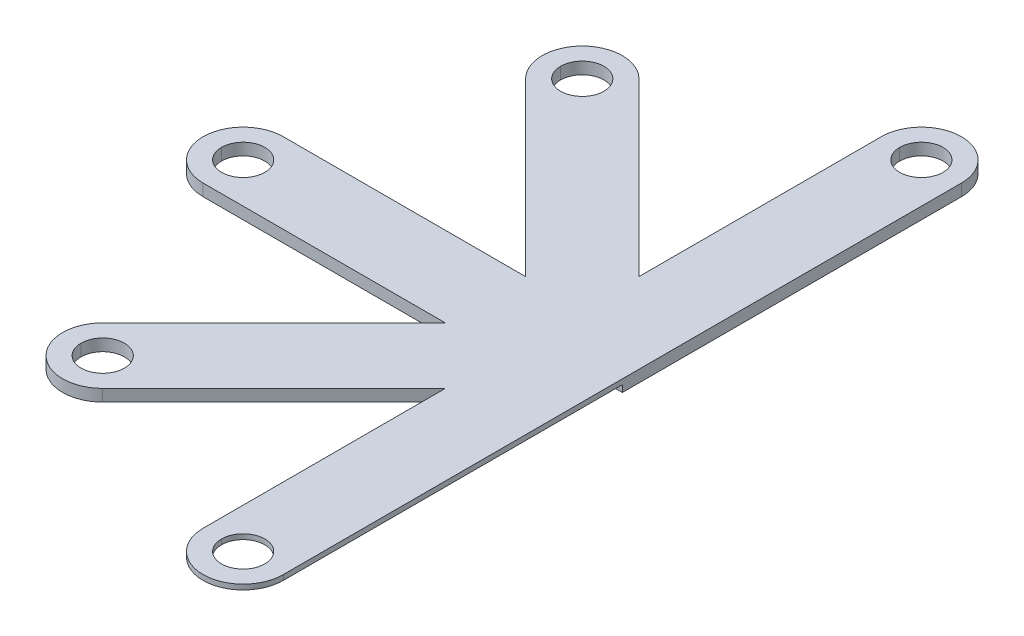
ISO-10303-21;
HEADER;
FILE_DESCRIPTION(('STEP AP214'),'2;1');
FILE_NAME('part.step','',(''),(''),'','','');
FILE_SCHEMA(('AUTOMOTIVE_DESIGN { 1 0 10303 214 1 1 1 1 }'));
ENDSEC;
DATA;
#1=APPLICATION_CONTEXT('core data for automotive mechanical design processes');
#2=APPLICATION_PROTOCOL_DEFINITION('international standard','automotive_design',2000,#1);
#3=PRODUCT_CONTEXT('',#1,'mechanical');
#4=PRODUCT('Part','Part','',(#3));
#5=PRODUCT_RELATED_PRODUCT_CATEGORY('part','',(#4));
#6=PRODUCT_DEFINITION_FORMATION('','',#4);
#7=PRODUCT_DEFINITION_CONTEXT('part definition',#1,'design');
#8=PRODUCT_DEFINITION('design','',#6,#7);
#9=PRODUCT_DEFINITION_SHAPE('','',#8);
#10=(LENGTH_UNIT() NAMED_UNIT(*) SI_UNIT(.MILLI.,.METRE.));
#11=(NAMED_UNIT(*) PLANE_ANGLE_UNIT() SI_UNIT($,.RADIAN.));
#12=(NAMED_UNIT(*) SI_UNIT($,.STERADIAN.) SOLID_ANGLE_UNIT());
#13=UNCERTAINTY_MEASURE_WITH_UNIT(LENGTH_MEASURE(1.E-05),#10,'distance_accuracy_value','');
#14=(GEOMETRIC_REPRESENTATION_CONTEXT(3) GLOBAL_UNCERTAINTY_ASSIGNED_CONTEXT((#13)) GLOBAL_UNIT_ASSIGNED_CONTEXT((#10,
#11,#12)) REPRESENTATION_CONTEXT('',''));
#15=CARTESIAN_POINT('',(0.,0.,0.));
#16=DIRECTION('',(0.,0.,1.));
#17=DIRECTION('',(1.,0.,0.));
#18=AXIS2_PLACEMENT_3D('',#15,#16,#17);
#19=CARTESIAN_POINT('',(-20.2946,-0.7112,2.4003));
#20=DIRECTION('',(0.,0.,1.));
#21=DIRECTION('',(1.,0.,0.));
#22=AXIS2_PLACEMENT_3D('',#19,#20,#21);
#23=PLANE('',#22);
#24=DIRECTION('',(1.,0.,0.));
#25=VECTOR('',#24,1.);
#26=CARTESIAN_POINT('',(-20.2946,-0.7112,2.4003));
#27=LINE('',#26,#25);
#28=CARTESIAN_POINT('',(-20.2946,-0.7112,2.4003));
#29=VERTEX_POINT('',#28);
#30=CARTESIAN_POINT('',(-5.79483681376443,-0.7112,2.4003));
#31=VERTEX_POINT('',#30);
#32=EDGE_CURVE('E11',#29,#31,#27,.T.);
#33=ORIENTED_EDGE('',*,*,#32,.T.);
#34=DIRECTION('',(0.,1.,0.));
#35=VECTOR('',#34,1.);
#36=CARTESIAN_POINT('',(-5.79483681376443,-0.7112,2.4003));
#37=LINE('',#36,#35);
#38=CARTESIAN_POINT('',(-5.79483681376443,0.,2.4003));
#39=VERTEX_POINT('',#38);
#40=EDGE_CURVE('E24',#31,#39,#37,.T.);
#41=ORIENTED_EDGE('',*,*,#40,.T.);
#42=DIRECTION('',(1.,0.,0.));
#43=VECTOR('',#42,1.);
#44=CARTESIAN_POINT('',(-20.2946,0.,2.4003));
#45=LINE('',#44,#43);
#46=CARTESIAN_POINT('',(-20.2946,0.,2.4003));
#47=VERTEX_POINT('',#46);
#48=EDGE_CURVE('E713',#47,#39,#45,.T.);
#49=ORIENTED_EDGE('',*,*,#48,.F.);
#50=DIRECTION('',(0.,1.,0.));
#51=VECTOR('',#50,1.);
#52=CARTESIAN_POINT('',(-20.2946,-0.7112,2.4003));
#53=LINE('',#52,#51);
#54=EDGE_CURVE('E708',#29,#47,#53,.T.);
#55=ORIENTED_EDGE('',*,*,#54,.F.);
#56=EDGE_LOOP('',(#33,#41,#49,#55));
#57=FACE_BOUND('',#56,.T.);
#58=ADVANCED_FACE('F16',(#57),#23,.T.);
#59=CARTESIAN_POINT('',(-20.2946,-0.7112,0.));
#60=DIRECTION('',(0.,-1.,0.));
#61=DIRECTION('',(1.,0.,0.));
#62=AXIS2_PLACEMENT_3D('',#59,#60,#61);
#63=CYLINDRICAL_SURFACE('',#62,2.4003);
#64=CARTESIAN_POINT('',(-20.2946,0.,0.));
#65=DIRECTION('',(0.,1.,0.));
#66=DIRECTION('',(1.,0.,0.));
#67=AXIS2_PLACEMENT_3D('',#64,#65,#66);
#68=CIRCLE('',#67,2.4003);
#69=CARTESIAN_POINT('',(-20.2946,0.,-2.4003));
#70=VERTEX_POINT('',#69);
#71=EDGE_CURVE('E703',#70,#47,#68,.T.);
#72=ORIENTED_EDGE('',*,*,#71,.F.);
#73=DIRECTION('',(0.,1.,0.));
#74=VECTOR('',#73,1.);
#75=CARTESIAN_POINT('',(-20.2946,-0.7112,-2.4003));
#76=LINE('',#75,#74);
#77=CARTESIAN_POINT('',(-20.2946,-0.7112,-2.4003));
#78=VERTEX_POINT('',#77);
#79=EDGE_CURVE('E698',#78,#70,#76,.T.);
#80=ORIENTED_EDGE('',*,*,#79,.F.);
#81=CARTESIAN_POINT('',(-20.2946,-0.7112,0.));
#82=DIRECTION('',(0.,1.,0.));
#83=DIRECTION('',(1.,0.,0.));
#84=AXIS2_PLACEMENT_3D('',#81,#82,#83);
#85=CIRCLE('',#84,2.4003);
#86=EDGE_CURVE('E693',#78,#29,#85,.T.);
#87=ORIENTED_EDGE('',*,*,#86,.T.);
#88=ORIENTED_EDGE('',*,*,#54,.T.);
#89=EDGE_LOOP('',(#72,#80,#87,#88));
#90=FACE_BOUND('',#89,.T.);
#91=ADVANCED_FACE('F860',(#90),#63,.T.);
#92=CARTESIAN_POINT('',(-14.3504492814685,-0.7112,14.3504492814685));
#93=DIRECTION('',(0.,1.,0.));
#94=DIRECTION('',(0.,0.,1.));
#95=AXIS2_PLACEMENT_3D('',#92,#93,#94);
#96=PLANE('',#95);
#97=DIRECTION('',(-0.707106781186528,0.,-0.707106781186567));
#98=VECTOR('',#97,1.);
#99=CARTESIAN_POINT('',(1.6972684068821,-0.7112,-1.6972684068821));
#100=LINE('',#99,#98);
#101=CARTESIAN_POINT('',(-2.4003,-0.7112,-5.79483681376443));
#102=VERTEX_POINT('',#101);
#103=CARTESIAN_POINT('',(-12.653180874586,-0.7112,-16.047717688351));
#104=VERTEX_POINT('',#103);
#105=EDGE_CURVE('E688',#102,#104,#100,.T.);
#106=ORIENTED_EDGE('',*,*,#105,.F.);
#107=DIRECTION('',(0.,0.,1.));
#108=VECTOR('',#107,1.);
#109=CARTESIAN_POINT('',(-2.4003,-0.7112,-20.2946));
#110=LINE('',#109,#108);
#111=CARTESIAN_POINT('',(-2.4003,-0.7112,-20.2946));
#112=VERTEX_POINT('',#111);
#113=EDGE_CURVE('E683',#112,#102,#110,.T.);
#114=ORIENTED_EDGE('',*,*,#113,.F.);
#115=CARTESIAN_POINT('',(0.,-0.7112,-20.2946));
#116=DIRECTION('',(0.,1.,0.));
#117=DIRECTION('',(1.,0.,0.));
#118=AXIS2_PLACEMENT_3D('',#115,#116,#117);
#119=CIRCLE('',#118,2.4003);
#120=CARTESIAN_POINT('',(2.4003,-0.7112,-20.2946));
#121=VERTEX_POINT('',#120);
#122=EDGE_CURVE('E678',#121,#112,#119,.T.);
#123=ORIENTED_EDGE('',*,*,#122,.F.);
#124=DIRECTION('',(0.,0.,-1.));
#125=VECTOR('',#124,1.);
#126=CARTESIAN_POINT('',(2.4003,-0.7112,0.));
#127=LINE('',#126,#125);
#128=CARTESIAN_POINT('',(2.4003,-0.7112,0.));
#129=VERTEX_POINT('',#128);
#130=EDGE_CURVE('E673',#129,#121,#127,.T.);
#131=ORIENTED_EDGE('',*,*,#130,.F.);
#132=DIRECTION('',(1.,0.,0.));
#133=VECTOR('',#132,1.);
#134=CARTESIAN_POINT('',(-2.4003,-0.7112,0.));
#135=LINE('',#134,#133);
#136=CARTESIAN_POINT('',(0.,-0.7112,0.));
#137=VERTEX_POINT('',#136);
#138=EDGE_CURVE('E668',#137,#129,#135,.T.);
#139=ORIENTED_EDGE('',*,*,#138,.F.);
#140=DIRECTION('',(-0.707106781186548,0.,-0.707106781186548));
#141=VECTOR('',#140,1.);
#142=CARTESIAN_POINT('',(1.6972684068821,-0.7112,1.6972684068821));
#143=LINE('',#142,#141);
#144=CARTESIAN_POINT('',(1.6972684068821,-0.7112,1.6972684068821));
#145=VERTEX_POINT('',#144);
#146=EDGE_CURVE('E663',#145,#137,#143,.T.);
#147=ORIENTED_EDGE('',*,*,#146,.F.);
#148=DIRECTION('',(0.707106781186528,0.,-0.707106781186567));
#149=VECTOR('',#148,1.);
#150=CARTESIAN_POINT('',(-12.653180874586,-0.7112,16.047717688351));
#151=LINE('',#150,#149);
#152=CARTESIAN_POINT('',(-12.653180874586,-0.7112,16.047717688351));
#153=VERTEX_POINT('',#152);
#154=EDGE_CURVE('E658',#153,#145,#151,.T.);
#155=ORIENTED_EDGE('',*,*,#154,.F.);
#156=CARTESIAN_POINT('',(-14.3504492814685,-0.7112,14.3504492814685));
#157=DIRECTION('',(0.,1.,0.));
#158=DIRECTION('',(1.,0.,0.));
#159=AXIS2_PLACEMENT_3D('',#156,#157,#158);
#160=CIRCLE('',#159,2.40030000000061);
#161=CARTESIAN_POINT('',(-16.047717688351,-0.7112,12.653180874586));
#162=VERTEX_POINT('',#161);
#163=EDGE_CURVE('E653',#162,#153,#160,.T.);
#164=ORIENTED_EDGE('',*,*,#163,.F.);
#165=DIRECTION('',(-0.707106781186567,0.,0.707106781186528));
#166=VECTOR('',#165,1.);
#167=CARTESIAN_POINT('',(-1.6972684068821,-0.7112,-1.6972684068821));
#168=LINE('',#167,#166);
#169=EDGE_CURVE('E648',#31,#162,#168,.T.);
#170=ORIENTED_EDGE('',*,*,#169,.F.);
#171=ORIENTED_EDGE('',*,*,#32,.F.);
#172=ORIENTED_EDGE('',*,*,#86,.F.);
#173=DIRECTION('',(-1.,0.,0.));
#174=VECTOR('',#173,1.);
#175=CARTESIAN_POINT('',(0.,-0.7112,-2.4003));
#176=LINE('',#175,#174);
#177=CARTESIAN_POINT('',(-5.79483681376443,-0.7112,-2.4003));
#178=VERTEX_POINT('',#177);
#179=EDGE_CURVE('E643',#178,#78,#176,.T.);
#180=ORIENTED_EDGE('',*,*,#179,.F.);
#181=DIRECTION('',(0.707106781186567,0.,0.707106781186528));
#182=VECTOR('',#181,1.);
#183=CARTESIAN_POINT('',(-16.047717688351,-0.7112,-12.653180874586));
#184=LINE('',#183,#182);
#185=CARTESIAN_POINT('',(-16.047717688351,-0.7112,-12.653180874586));
#186=VERTEX_POINT('',#185);
#187=EDGE_CURVE('E638',#186,#178,#184,.T.);
#188=ORIENTED_EDGE('',*,*,#187,.F.);
#189=CARTESIAN_POINT('',(-14.3504492814685,-0.7112,-14.3504492814685));
#190=DIRECTION('',(0.,1.,0.));
#191=DIRECTION('',(1.,0.,0.));
#192=AXIS2_PLACEMENT_3D('',#189,#190,#191);
#193=CIRCLE('',#192,2.40030000000061);
#194=EDGE_CURVE('E633',#104,#186,#193,.T.);
#195=ORIENTED_EDGE('',*,*,#194,.F.);
#196=EDGE_LOOP('',(#106,#114,#123,#131,#139,#147,#155,#164,#170,#171,#172,#180,#188,#195));
#197=FACE_BOUND('',#196,.T.);
#198=CARTESIAN_POINT('',(-14.350449281469,-0.7112,14.350449281469));
#199=DIRECTION('',(0.,1.,0.));
#200=DIRECTION('',(1.,0.,0.));
#201=AXIS2_PLACEMENT_3D('',#198,#199,#200);
#202=CIRCLE('',#201,1.2954);
#203=CARTESIAN_POINT('',(-13.055049281469,-0.7112,14.350449281469));
#204=VERTEX_POINT('',#203);
#205=CARTESIAN_POINT('',(-15.645849281469,-0.7112,14.350449281469));
#206=VERTEX_POINT('',#205);
#207=EDGE_CURVE('E629',#204,#206,#202,.T.);
#208=ORIENTED_EDGE('',*,*,#207,.T.);
#209=CARTESIAN_POINT('',(-14.350449281469,-0.7112,14.350449281469));
#210=DIRECTION('',(0.,1.,0.));
#211=DIRECTION('',(1.,0.,0.));
#212=AXIS2_PLACEMENT_3D('',#209,#210,#211);
#213=CIRCLE('',#212,1.2954);
#214=EDGE_CURVE('E625',#206,#204,#213,.T.);
#215=ORIENTED_EDGE('',*,*,#214,.T.);
#216=EDGE_LOOP('',(#208,#215));
#217=FACE_BOUND('',#216,.T.);
#218=CARTESIAN_POINT('',(-20.2946,-0.7112,0.));
#219=DIRECTION('',(0.,1.,0.));
#220=DIRECTION('',(1.,0.,0.));
#221=AXIS2_PLACEMENT_3D('',#218,#219,#220);
#222=CIRCLE('',#221,1.2954);
#223=CARTESIAN_POINT('',(-18.9992,-0.7112,0.));
#224=VERTEX_POINT('',#223);
#225=CARTESIAN_POINT('',(-21.59,-0.7112,0.));
#226=VERTEX_POINT('',#225);
#227=EDGE_CURVE('E621',#224,#226,#222,.T.);
#228=ORIENTED_EDGE('',*,*,#227,.T.);
#229=CARTESIAN_POINT('',(-20.2946,-0.7112,0.));
#230=DIRECTION('',(0.,1.,0.));
#231=DIRECTION('',(1.,0.,0.));
#232=AXIS2_PLACEMENT_3D('',#229,#230,#231);
#233=CIRCLE('',#232,1.2954);
#234=EDGE_CURVE('E617',#226,#224,#233,.T.);
#235=ORIENTED_EDGE('',*,*,#234,.T.);
#236=EDGE_LOOP('',(#228,#235));
#237=FACE_BOUND('',#236,.T.);
#238=CARTESIAN_POINT('',(-14.350449281469,-0.7112,-14.350449281469));
#239=DIRECTION('',(0.,1.,0.));
#240=DIRECTION('',(1.,0.,0.));
#241=AXIS2_PLACEMENT_3D('',#238,#239,#240);
#242=CIRCLE('',#241,1.2954);
#243=CARTESIAN_POINT('',(-13.055049281469,-0.7112,-14.350449281469));
#244=VERTEX_POINT('',#243);
#245=CARTESIAN_POINT('',(-15.645849281469,-0.7112,-14.350449281469));
#246=VERTEX_POINT('',#245);
#247=EDGE_CURVE('E613',#244,#246,#242,.T.);
#248=ORIENTED_EDGE('',*,*,#247,.T.);
#249=CARTESIAN_POINT('',(-14.350449281469,-0.7112,-14.350449281469));
#250=DIRECTION('',(0.,1.,0.));
#251=DIRECTION('',(1.,0.,0.));
#252=AXIS2_PLACEMENT_3D('',#249,#250,#251);
#253=CIRCLE('',#252,1.2954);
#254=EDGE_CURVE('E609',#246,#244,#253,.T.);
#255=ORIENTED_EDGE('',*,*,#254,.T.);
#256=EDGE_LOOP('',(#248,#255));
#257=FACE_BOUND('',#256,.T.);
#258=CARTESIAN_POINT('',(0.,-0.7112,-20.2946));
#259=DIRECTION('',(0.,1.,0.));
#260=DIRECTION('',(1.,0.,0.));
#261=AXIS2_PLACEMENT_3D('',#258,#259,#260);
#262=CIRCLE('',#261,1.2954);
#263=CARTESIAN_POINT('',(1.2954,-0.7112,-20.2946));
#264=VERTEX_POINT('',#263);
#265=CARTESIAN_POINT('',(-1.2954,-0.7112,-20.2946));
#266=VERTEX_POINT('',#265);
#267=EDGE_CURVE('E605',#264,#266,#262,.T.);
#268=ORIENTED_EDGE('',*,*,#267,.T.);
#269=CARTESIAN_POINT('',(0.,-0.7112,-20.2946));
#270=DIRECTION('',(0.,1.,0.));
#271=DIRECTION('',(1.,0.,0.));
#272=AXIS2_PLACEMENT_3D('',#269,#270,#271);
#273=CIRCLE('',#272,1.2954);
#274=EDGE_CURVE('E603',#266,#264,#273,.T.);
#275=ORIENTED_EDGE('',*,*,#274,.T.);
#276=EDGE_LOOP('',(#268,#275));
#277=FACE_BOUND('',#276,.T.);
#278=ADVANCED_FACE('F814',(#197,#217,#237,#257,#277),#96,.F.);
#279=CARTESIAN_POINT('',(0.,-0.7112,-20.2946));
#280=DIRECTION('',(0.,-1.,0.));
#281=DIRECTION('',(0.,0.,-1.));
#282=AXIS2_PLACEMENT_3D('',#279,#280,#281);
#283=CYLINDRICAL_SURFACE('',#282,1.2954);
#284=ORIENTED_EDGE('',*,*,#274,.F.);
#285=CARTESIAN_POINT('',(-1.2954,0.,-20.2946));
#286=DIRECTION('',(0.,-1.,0.));
#287=VECTOR('',#286,1.);
#288=LINE('',#285,#287);
#289=CARTESIAN_POINT('',(-1.2954,0.,-20.2946));
#290=VERTEX_POINT('',#289);
#291=EDGE_CURVE('E573',#290,#266,#288,.T.);
#292=ORIENTED_EDGE('',*,*,#291,.F.);
#293=CARTESIAN_POINT('',(0.,0.,-20.2946));
#294=DIRECTION('',(0.,1.,0.));
#295=DIRECTION('',(1.,0.,0.));
#296=AXIS2_PLACEMENT_3D('',#293,#294,#295);
#297=CIRCLE('',#296,1.2954);
#298=CARTESIAN_POINT('',(1.2954,0.,-20.2946));
#299=VERTEX_POINT('',#298);
#300=EDGE_CURVE('E590',#290,#299,#297,.T.);
#301=ORIENTED_EDGE('',*,*,#300,.T.);
#302=CARTESIAN_POINT('',(1.2954,0.,-20.2946));
#303=DIRECTION('',(0.,-1.,0.));
#304=VECTOR('',#303,1.);
#305=LINE('',#302,#304);
#306=EDGE_CURVE('E575',#299,#264,#305,.T.);
#307=ORIENTED_EDGE('',*,*,#306,.T.);
#308=EDGE_LOOP('',(#284,#292,#301,#307));
#309=FACE_BOUND('',#308,.T.);
#310=ADVANCED_FACE('F556',(#309),#283,.F.);
#311=CARTESIAN_POINT('',(0.,-0.7112,-20.2946));
#312=DIRECTION('',(0.,-1.,0.));
#313=DIRECTION('',(0.,0.,1.));
#314=AXIS2_PLACEMENT_3D('',#311,#312,#313);
#315=CYLINDRICAL_SURFACE('',#314,1.2954);
#316=CARTESIAN_POINT('',(0.,0.,-20.2946));
#317=DIRECTION('',(0.,1.,0.));
#318=DIRECTION('',(1.,0.,0.));
#319=AXIS2_PLACEMENT_3D('',#316,#317,#318);
#320=CIRCLE('',#319,1.2954);
#321=EDGE_CURVE('E537',#299,#290,#320,.T.);
#322=ORIENTED_EDGE('',*,*,#321,.T.);
#323=ORIENTED_EDGE('',*,*,#291,.T.);
#324=ORIENTED_EDGE('',*,*,#267,.F.);
#325=ORIENTED_EDGE('',*,*,#306,.F.);
#326=EDGE_LOOP('',(#322,#323,#324,#325));
#327=FACE_BOUND('',#326,.T.);
#328=ADVANCED_FACE('F546',(#327),#315,.F.);
#329=CARTESIAN_POINT('',(0.,0.,20.2946));
#330=DIRECTION('',(0.,1.,0.));
#331=DIRECTION('',(0.,0.,1.));
#332=AXIS2_PLACEMENT_3D('',#329,#330,#331);
#333=PLANE('',#332);
#334=DIRECTION('',(0.,0.,1.));
#335=VECTOR('',#334,1.);
#336=CARTESIAN_POINT('',(-2.4003,0.,-20.2946));
#337=LINE('',#336,#335);
#338=CARTESIAN_POINT('',(-2.4003,0.,-20.2946));
#339=VERTEX_POINT('',#338);
#340=CARTESIAN_POINT('',(-2.4003,0.,-5.79483681376443));
#341=VERTEX_POINT('',#340);
#342=EDGE_CURVE('E533',#339,#341,#337,.T.);
#343=ORIENTED_EDGE('',*,*,#342,.T.);
#344=DIRECTION('',(-0.707106781186528,0.,-0.707106781186567));
#345=VECTOR('',#344,1.);
#346=CARTESIAN_POINT('',(1.6972684068821,0.,-1.6972684068821));
#347=LINE('',#346,#345);
#348=CARTESIAN_POINT('',(-12.653180874586,0.,-16.047717688351));
#349=VERTEX_POINT('',#348);
#350=EDGE_CURVE('E529',#341,#349,#347,.T.);
#351=ORIENTED_EDGE('',*,*,#350,.T.);
#352=CARTESIAN_POINT('',(-14.3504492814685,0.,-14.3504492814685));
#353=DIRECTION('',(0.,1.,0.));
#354=DIRECTION('',(1.,0.,0.));
#355=AXIS2_PLACEMENT_3D('',#352,#353,#354);
#356=CIRCLE('',#355,2.40030000000061);
#357=CARTESIAN_POINT('',(-16.047717688351,0.,-12.653180874586));
#358=VERTEX_POINT('',#357);
#359=EDGE_CURVE('E525',#349,#358,#356,.T.);
#360=ORIENTED_EDGE('',*,*,#359,.T.);
#361=DIRECTION('',(0.707106781186567,0.,0.707106781186528));
#362=VECTOR('',#361,1.);
#363=CARTESIAN_POINT('',(-16.047717688351,0.,-12.653180874586));
#364=LINE('',#363,#362);
#365=CARTESIAN_POINT('',(-5.79483681376443,0.,-2.4003));
#366=VERTEX_POINT('',#365);
#367=EDGE_CURVE('E521',#358,#366,#364,.T.);
#368=ORIENTED_EDGE('',*,*,#367,.T.);
#369=DIRECTION('',(-1.,0.,0.));
#370=VECTOR('',#369,1.);
#371=CARTESIAN_POINT('',(0.,0.,-2.4003));
#372=LINE('',#371,#370);
#373=EDGE_CURVE('E516',#366,#70,#372,.T.);
#374=ORIENTED_EDGE('',*,*,#373,.T.);
#375=ORIENTED_EDGE('',*,*,#71,.T.);
#376=ORIENTED_EDGE('',*,*,#48,.T.);
#377=DIRECTION('',(-0.707106781186567,0.,0.707106781186528));
#378=VECTOR('',#377,1.);
#379=CARTESIAN_POINT('',(-1.6972684068821,0.,-1.6972684068821));
#380=LINE('',#379,#378);
#381=CARTESIAN_POINT('',(-16.047717688351,0.,12.653180874586));
#382=VERTEX_POINT('',#381);
#383=EDGE_CURVE('E512',#39,#382,#380,.T.);
#384=ORIENTED_EDGE('',*,*,#383,.T.);
#385=CARTESIAN_POINT('',(-14.3504492814685,0.,14.3504492814685));
#386=DIRECTION('',(0.,1.,0.));
#387=DIRECTION('',(1.,0.,0.));
#388=AXIS2_PLACEMENT_3D('',#385,#386,#387);
#389=CIRCLE('',#388,2.40030000000061);
#390=CARTESIAN_POINT('',(-12.653180874586,0.,16.047717688351));
#391=VERTEX_POINT('',#390);
#392=EDGE_CURVE('E508',#382,#391,#389,.T.);
#393=ORIENTED_EDGE('',*,*,#392,.T.);
#394=DIRECTION('',(0.707106781186528,0.,-0.707106781186567));
#395=VECTOR('',#394,1.);
#396=CARTESIAN_POINT('',(-12.653180874586,0.,16.047717688351));
#397=LINE('',#396,#395);
#398=CARTESIAN_POINT('',(-2.4003,0.,5.79483681376443));
#399=VERTEX_POINT('',#398);
#400=EDGE_CURVE('E504',#391,#399,#397,.T.);
#401=ORIENTED_EDGE('',*,*,#400,.T.);
#402=DIRECTION('',(0.,0.,1.));
#403=VECTOR('',#402,1.);
#404=CARTESIAN_POINT('',(-2.4003,0.,0.));
#405=LINE('',#404,#403);
#406=CARTESIAN_POINT('',(-2.4003,0.,20.2946));
#407=VERTEX_POINT('',#406);
#408=EDGE_CURVE('E500',#399,#407,#405,.T.);
#409=ORIENTED_EDGE('',*,*,#408,.T.);
#410=CARTESIAN_POINT('',(0.,0.,20.2946));
#411=DIRECTION('',(0.,1.,0.));
#412=DIRECTION('',(1.,0.,0.));
#413=AXIS2_PLACEMENT_3D('',#410,#411,#412);
#414=CIRCLE('',#413,2.4003);
#415=CARTESIAN_POINT('',(2.4003,0.,20.2946));
#416=VERTEX_POINT('',#415);
#417=EDGE_CURVE('E206',#407,#416,#414,.T.);
#418=ORIENTED_EDGE('',*,*,#417,.T.);
#419=DIRECTION('',(0.,0.,-1.));
#420=VECTOR('',#419,1.);
#421=CARTESIAN_POINT('',(2.4003,0.,20.2946));
#422=LINE('',#421,#420);
#423=CARTESIAN_POINT('',(2.4003,0.,-20.2946));
#424=VERTEX_POINT('',#423);
#425=EDGE_CURVE('E493',#416,#424,#422,.T.);
#426=ORIENTED_EDGE('',*,*,#425,.T.);
#427=CARTESIAN_POINT('',(0.,0.,-20.2946));
#428=DIRECTION('',(0.,1.,0.));
#429=DIRECTION('',(1.,0.,0.));
#430=AXIS2_PLACEMENT_3D('',#427,#428,#429);
#431=CIRCLE('',#430,2.4003);
#432=EDGE_CURVE('E489',#424,#339,#431,.T.);
#433=ORIENTED_EDGE('',*,*,#432,.T.);
#434=EDGE_LOOP('',(#343,#351,#360,#368,#374,#375,#376,#384,#393,#401,#409,#418,#426,#433));
#435=FACE_BOUND('',#434,.T.);
#436=CARTESIAN_POINT('',(0.,0.,20.2946));
#437=DIRECTION('',(0.,1.,0.));
#438=DIRECTION('',(1.,0.,0.));
#439=AXIS2_PLACEMENT_3D('',#436,#437,#438);
#440=CIRCLE('',#439,1.2954);
#441=CARTESIAN_POINT('',(1.2954,0.,20.2946));
#442=VERTEX_POINT('',#441);
#443=CARTESIAN_POINT('',(-1.2954,0.,20.2946));
#444=VERTEX_POINT('',#443);
#445=EDGE_CURVE('E485',#442,#444,#440,.T.);
#446=ORIENTED_EDGE('',*,*,#445,.F.);
#447=CARTESIAN_POINT('',(0.,0.,20.2946));
#448=DIRECTION('',(0.,1.,0.));
#449=DIRECTION('',(1.,0.,0.));
#450=AXIS2_PLACEMENT_3D('',#447,#448,#449);
#451=CIRCLE('',#450,1.2954);
#452=EDGE_CURVE('E481',#444,#442,#451,.T.);
#453=ORIENTED_EDGE('',*,*,#452,.F.);
#454=EDGE_LOOP('',(#446,#453));
#455=FACE_BOUND('',#454,.T.);
#456=CARTESIAN_POINT('',(-14.350449281469,0.,14.350449281469));
#457=DIRECTION('',(0.,1.,0.));
#458=DIRECTION('',(1.,0.,0.));
#459=AXIS2_PLACEMENT_3D('',#456,#457,#458);
#460=CIRCLE('',#459,1.2954);
#461=CARTESIAN_POINT('',(-13.055049281469,0.,14.350449281469));
#462=VERTEX_POINT('',#461);
#463=CARTESIAN_POINT('',(-15.645849281469,0.,14.350449281469));
#464=VERTEX_POINT('',#463);
#465=EDGE_CURVE('E477',#462,#464,#460,.T.);
#466=ORIENTED_EDGE('',*,*,#465,.F.);
#467=CARTESIAN_POINT('',(-14.350449281469,0.,14.350449281469));
#468=DIRECTION('',(0.,1.,0.));
#469=DIRECTION('',(1.,0.,0.));
#470=AXIS2_PLACEMENT_3D('',#467,#468,#469);
#471=CIRCLE('',#470,1.2954);
#472=EDGE_CURVE('E473',#464,#462,#471,.T.);
#473=ORIENTED_EDGE('',*,*,#472,.F.);
#474=EDGE_LOOP('',(#466,#473));
#475=FACE_BOUND('',#474,.T.);
#476=CARTESIAN_POINT('',(-20.2946,0.,0.));
#477=DIRECTION('',(0.,1.,0.));
#478=DIRECTION('',(1.,0.,0.));
#479=AXIS2_PLACEMENT_3D('',#476,#477,#478);
#480=CIRCLE('',#479,1.2954);
#481=CARTESIAN_POINT('',(-18.9992,0.,0.));
#482=VERTEX_POINT('',#481);
#483=CARTESIAN_POINT('',(-21.59,0.,0.));
#484=VERTEX_POINT('',#483);
#485=EDGE_CURVE('E469',#482,#484,#480,.T.);
#486=ORIENTED_EDGE('',*,*,#485,.F.);
#487=CARTESIAN_POINT('',(-20.2946,0.,0.));
#488=DIRECTION('',(0.,1.,0.));
#489=DIRECTION('',(1.,0.,0.));
#490=AXIS2_PLACEMENT_3D('',#487,#488,#489);
#491=CIRCLE('',#490,1.2954);
#492=EDGE_CURVE('E465',#484,#482,#491,.T.);
#493=ORIENTED_EDGE('',*,*,#492,.F.);
#494=EDGE_LOOP('',(#486,#493));
#495=FACE_BOUND('',#494,.T.);
#496=CARTESIAN_POINT('',(-14.350449281469,0.,-14.350449281469));
#497=DIRECTION('',(0.,1.,0.));
#498=DIRECTION('',(1.,0.,0.));
#499=AXIS2_PLACEMENT_3D('',#496,#497,#498);
#500=CIRCLE('',#499,1.2954);
#501=CARTESIAN_POINT('',(-13.055049281469,0.,-14.350449281469));
#502=VERTEX_POINT('',#501);
#503=CARTESIAN_POINT('',(-15.645849281469,0.,-14.350449281469));
#504=VERTEX_POINT('',#503);
#505=EDGE_CURVE('E461',#502,#504,#500,.T.);
#506=ORIENTED_EDGE('',*,*,#505,.F.);
#507=CARTESIAN_POINT('',(-14.350449281469,0.,-14.350449281469));
#508=DIRECTION('',(0.,1.,0.));
#509=DIRECTION('',(1.,0.,0.));
#510=AXIS2_PLACEMENT_3D('',#507,#508,#509);
#511=CIRCLE('',#510,1.2954);
#512=EDGE_CURVE('E459',#504,#502,#511,.T.);
#513=ORIENTED_EDGE('',*,*,#512,.F.);
#514=EDGE_LOOP('',(#506,#513));
#515=FACE_BOUND('',#514,.T.);
#516=ORIENTED_EDGE('',*,*,#321,.F.);
#517=ORIENTED_EDGE('',*,*,#300,.F.);
#518=EDGE_LOOP('',(#516,#517));
#519=FACE_BOUND('',#518,.T.);
#520=ADVANCED_FACE('F555',(#435,#455,#475,#495,#515,#519),#333,.T.);
#521=CARTESIAN_POINT('',(-14.350449281469,-0.7112,-14.350449281469));
#522=DIRECTION('',(0.,-1.,0.));
#523=DIRECTION('',(0.,0.,-1.));
#524=AXIS2_PLACEMENT_3D('',#521,#522,#523);
#525=CYLINDRICAL_SURFACE('',#524,1.2954);
#526=ORIENTED_EDGE('',*,*,#254,.F.);
#527=CARTESIAN_POINT('',(-15.645849281469,0.,-14.350449281469));
#528=DIRECTION('',(0.,-1.,0.));
#529=VECTOR('',#528,1.);
#530=LINE('',#527,#529);
#531=EDGE_CURVE('E435',#504,#246,#530,.T.);
#532=ORIENTED_EDGE('',*,*,#531,.F.);
#533=ORIENTED_EDGE('',*,*,#512,.T.);
#534=CARTESIAN_POINT('',(-13.055049281469,0.,-14.350449281469));
#535=DIRECTION('',(0.,-1.,0.));
#536=VECTOR('',#535,1.);
#537=LINE('',#534,#536);
#538=EDGE_CURVE('E449',#502,#244,#537,.T.);
#539=ORIENTED_EDGE('',*,*,#538,.T.);
#540=EDGE_LOOP('',(#526,#532,#533,#539));
#541=FACE_BOUND('',#540,.T.);
#542=ADVANCED_FACE('F417',(#541),#525,.F.);
#543=CARTESIAN_POINT('',(-14.350449281469,-0.7112,-14.350449281469));
#544=DIRECTION('',(0.,-1.,0.));
#545=DIRECTION('',(0.,0.,1.));
#546=AXIS2_PLACEMENT_3D('',#543,#544,#545);
#547=CYLINDRICAL_SURFACE('',#546,1.2954);
#548=ORIENTED_EDGE('',*,*,#505,.T.);
#549=ORIENTED_EDGE('',*,*,#531,.T.);
#550=ORIENTED_EDGE('',*,*,#247,.F.);
#551=ORIENTED_EDGE('',*,*,#538,.F.);
#552=EDGE_LOOP('',(#548,#549,#550,#551));
#553=FACE_BOUND('',#552,.T.);
#554=ADVANCED_FACE('F408',(#553),#547,.F.);
#555=CARTESIAN_POINT('',(-20.2946,-0.7112,0.));
#556=DIRECTION('',(0.,-1.,0.));
#557=DIRECTION('',(0.,0.,-1.));
#558=AXIS2_PLACEMENT_3D('',#555,#556,#557);
#559=CYLINDRICAL_SURFACE('',#558,1.2954);
#560=ORIENTED_EDGE('',*,*,#234,.F.);
#561=CARTESIAN_POINT('',(-21.59,0.,0.));
#562=DIRECTION('',(0.,-1.,0.));
#563=VECTOR('',#562,1.);
#564=LINE('',#561,#563);
#565=EDGE_CURVE('E379',#484,#226,#564,.T.);
#566=ORIENTED_EDGE('',*,*,#565,.F.);
#567=ORIENTED_EDGE('',*,*,#492,.T.);
#568=CARTESIAN_POINT('',(-18.9992,0.,0.));
#569=DIRECTION('',(0.,-1.,0.));
#570=VECTOR('',#569,1.);
#571=LINE('',#568,#570);
#572=EDGE_CURVE('E393',#482,#224,#571,.T.);
#573=ORIENTED_EDGE('',*,*,#572,.T.);
#574=EDGE_LOOP('',(#560,#566,#567,#573));
#575=FACE_BOUND('',#574,.T.);
#576=ADVANCED_FACE('F361',(#575),#559,.F.);
#577=CARTESIAN_POINT('',(-20.2946,-0.7112,0.));
#578=DIRECTION('',(0.,-1.,0.));
#579=DIRECTION('',(0.,0.,1.));
#580=AXIS2_PLACEMENT_3D('',#577,#578,#579);
#581=CYLINDRICAL_SURFACE('',#580,1.2954);
#582=ORIENTED_EDGE('',*,*,#485,.T.);
#583=ORIENTED_EDGE('',*,*,#565,.T.);
#584=ORIENTED_EDGE('',*,*,#227,.F.);
#585=ORIENTED_EDGE('',*,*,#572,.F.);
#586=EDGE_LOOP('',(#582,#583,#584,#585));
#587=FACE_BOUND('',#586,.T.);
#588=ADVANCED_FACE('F352',(#587),#581,.F.);
#589=CARTESIAN_POINT('',(-14.350449281469,-0.7112,14.350449281469));
#590=DIRECTION('',(0.,-1.,0.));
#591=DIRECTION('',(0.,0.,-1.));
#592=AXIS2_PLACEMENT_3D('',#589,#590,#591);
#593=CYLINDRICAL_SURFACE('',#592,1.2954);
#594=ORIENTED_EDGE('',*,*,#214,.F.);
#595=CARTESIAN_POINT('',(-15.645849281469,0.,14.350449281469));
#596=DIRECTION('',(0.,-1.,0.));
#597=VECTOR('',#596,1.);
#598=LINE('',#595,#597);
#599=EDGE_CURVE('E324',#464,#206,#598,.T.);
#600=ORIENTED_EDGE('',*,*,#599,.F.);
#601=ORIENTED_EDGE('',*,*,#472,.T.);
#602=CARTESIAN_POINT('',(-13.055049281469,0.,14.350449281469));
#603=DIRECTION('',(0.,-1.,0.));
#604=VECTOR('',#603,1.);
#605=LINE('',#602,#604);
#606=EDGE_CURVE('E289',#462,#204,#605,.T.);
#607=ORIENTED_EDGE('',*,*,#606,.T.);
#608=EDGE_LOOP('',(#594,#600,#601,#607));
#609=FACE_BOUND('',#608,.T.);
#610=ADVANCED_FACE('F306',(#609),#593,.F.);
#611=CARTESIAN_POINT('',(-14.350449281469,-0.7112,14.350449281469));
#612=DIRECTION('',(0.,-1.,0.));
#613=DIRECTION('',(0.,0.,1.));
#614=AXIS2_PLACEMENT_3D('',#611,#612,#613);
#615=CYLINDRICAL_SURFACE('',#614,1.2954);
#616=ORIENTED_EDGE('',*,*,#465,.T.);
#617=ORIENTED_EDGE('',*,*,#599,.T.);
#618=ORIENTED_EDGE('',*,*,#207,.F.);
#619=ORIENTED_EDGE('',*,*,#606,.F.);
#620=EDGE_LOOP('',(#616,#617,#618,#619));
#621=FACE_BOUND('',#620,.T.);
#622=ADVANCED_FACE('F297',(#621),#615,.F.);
#623=CARTESIAN_POINT('',(0.,-0.3048,20.2946));
#624=DIRECTION('',(0.,-1.,0.));
#625=DIRECTION('',(0.,0.,-1.));
#626=AXIS2_PLACEMENT_3D('',#623,#624,#625);
#627=CYLINDRICAL_SURFACE('',#626,1.2954);
#628=CARTESIAN_POINT('',(0.,-0.3048,20.2946));
#629=DIRECTION('',(0.,1.,0.));
#630=DIRECTION('',(1.,0.,0.));
#631=AXIS2_PLACEMENT_3D('',#628,#629,#630);
#632=CIRCLE('',#631,1.2954);
#633=CARTESIAN_POINT('',(-1.2954,-0.3048,20.2946));
#634=VERTEX_POINT('',#633);
#635=CARTESIAN_POINT('',(1.2954,-0.3048,20.2946));
#636=VERTEX_POINT('',#635);
#637=EDGE_CURVE('E286',#634,#636,#632,.T.);
#638=ORIENTED_EDGE('',*,*,#637,.F.);
#639=CARTESIAN_POINT('',(-1.2954,0.,20.2946));
#640=DIRECTION('',(0.,-1.,0.));
#641=VECTOR('',#640,1.);
#642=LINE('',#639,#641);
#643=EDGE_CURVE('E265',#444,#634,#642,.T.);
#644=ORIENTED_EDGE('',*,*,#643,.F.);
#645=ORIENTED_EDGE('',*,*,#452,.T.);
#646=CARTESIAN_POINT('',(1.2954,0.,20.2946));
#647=DIRECTION('',(0.,-1.,0.));
#648=VECTOR('',#647,1.);
#649=LINE('',#646,#648);
#650=EDGE_CURVE('E219',#442,#636,#649,.T.);
#651=ORIENTED_EDGE('',*,*,#650,.T.);
#652=EDGE_LOOP('',(#638,#644,#645,#651));
#653=FACE_BOUND('',#652,.T.);
#654=ADVANCED_FACE('F243',(#653),#627,.F.);
#655=CARTESIAN_POINT('',(0.,-0.3048,20.2946));
#656=DIRECTION('',(0.,-1.,0.));
#657=DIRECTION('',(0.,0.,1.));
#658=AXIS2_PLACEMENT_3D('',#655,#656,#657);
#659=CYLINDRICAL_SURFACE('',#658,1.2954);
#660=ORIENTED_EDGE('',*,*,#445,.T.);
#661=ORIENTED_EDGE('',*,*,#643,.T.);
#662=CARTESIAN_POINT('',(0.,-0.3048,20.2946));
#663=DIRECTION('',(0.,1.,0.));
#664=DIRECTION('',(1.,0.,0.));
#665=AXIS2_PLACEMENT_3D('',#662,#663,#664);
#666=CIRCLE('',#665,1.2954);
#667=EDGE_CURVE('E215',#636,#634,#666,.T.);
#668=ORIENTED_EDGE('',*,*,#667,.F.);
#669=ORIENTED_EDGE('',*,*,#650,.F.);
#670=EDGE_LOOP('',(#660,#661,#668,#669));
#671=FACE_BOUND('',#670,.T.);
#672=ADVANCED_FACE('F233',(#671),#659,.F.);
#673=CARTESIAN_POINT('',(0.,-0.3048,20.2946));
#674=DIRECTION('',(0.,1.,0.));
#675=DIRECTION('',(0.,0.,1.));
#676=AXIS2_PLACEMENT_3D('',#673,#674,#675);
#677=PLANE('',#676);
#678=ORIENTED_EDGE('',*,*,#667,.T.);
#679=ORIENTED_EDGE('',*,*,#637,.T.);
#680=EDGE_LOOP('',(#678,#679));
#681=FACE_BOUND('',#680,.T.);
#682=DIRECTION('',(0.,0.,1.));
#683=VECTOR('',#682,1.);
#684=CARTESIAN_POINT('',(-2.4003,-0.3048,0.));
#685=LINE('',#684,#683);
#686=CARTESIAN_POINT('',(-2.4003,-0.3048,5.79483681376443));
#687=VERTEX_POINT('',#686);
#688=CARTESIAN_POINT('',(-2.4003,-0.3048,20.2946));
#689=VERTEX_POINT('',#688);
#690=EDGE_CURVE('E194',#687,#689,#685,.T.);
#691=ORIENTED_EDGE('',*,*,#690,.F.);
#692=DIRECTION('',(0.707106781186528,0.,-0.707106781186567));
#693=VECTOR('',#692,1.);
#694=CARTESIAN_POINT('',(-8.45003159311785,-0.3048,11.8445684068826));
#695=LINE('',#694,#693);
#696=CARTESIAN_POINT('',(1.6972684068821,-0.3048,1.6972684068821));
#697=VERTEX_POINT('',#696);
#698=EDGE_CURVE('E216',#687,#697,#695,.T.);
#699=ORIENTED_EDGE('',*,*,#698,.T.);
#700=DIRECTION('',(-0.707106781186548,0.,-0.707106781186548));
#701=VECTOR('',#700,1.);
#702=CARTESIAN_POINT('',(10.1473,-0.3048,10.1473));
#703=LINE('',#702,#701);
#704=CARTESIAN_POINT('',(0.,-0.3048,0.));
#705=VERTEX_POINT('',#704);
#706=EDGE_CURVE('E221',#697,#705,#703,.T.);
#707=ORIENTED_EDGE('',*,*,#706,.T.);
#708=DIRECTION('',(-1.,0.,0.));
#709=VECTOR('',#708,1.);
#710=CARTESIAN_POINT('',(2.4003,-0.3048,0.));
#711=LINE('',#710,#709);
#712=CARTESIAN_POINT('',(2.4003,-0.3048,0.));
#713=VERTEX_POINT('',#712);
#714=EDGE_CURVE('E796',#713,#705,#711,.T.);
#715=ORIENTED_EDGE('',*,*,#714,.F.);
#716=DIRECTION('',(0.,0.,-1.));
#717=VECTOR('',#716,1.);
#718=CARTESIAN_POINT('',(2.4003,-0.3048,20.2946));
#719=LINE('',#718,#717);
#720=CARTESIAN_POINT('',(2.4003,-0.3048,20.2946));
#721=VERTEX_POINT('',#720);
#722=EDGE_CURVE('E197',#721,#713,#719,.T.);
#723=ORIENTED_EDGE('',*,*,#722,.F.);
#724=CARTESIAN_POINT('',(0.,-0.3048,20.2946));
#725=DIRECTION('',(0.,1.,0.));
#726=DIRECTION('',(1.,0.,0.));
#727=AXIS2_PLACEMENT_3D('',#724,#725,#726);
#728=CIRCLE('',#727,2.4003);
#729=EDGE_CURVE('E190',#689,#721,#728,.T.);
#730=ORIENTED_EDGE('',*,*,#729,.F.);
#731=EDGE_LOOP('',(#691,#699,#707,#715,#723,#730));
#732=FACE_BOUND('',#731,.T.);
#733=ADVANCED_FACE('F192',(#681,#732),#677,.F.);
#734=CARTESIAN_POINT('',(0.,-0.3048,20.2946));
#735=DIRECTION('',(0.,-1.,0.));
#736=DIRECTION('',(0.,0.,-1.));
#737=AXIS2_PLACEMENT_3D('',#734,#735,#736);
#738=CYLINDRICAL_SURFACE('',#737,2.4003);
#739=ORIENTED_EDGE('',*,*,#417,.F.);
#740=DIRECTION('',(0.,1.,0.));
#741=VECTOR('',#740,1.);
#742=CARTESIAN_POINT('',(-2.4003,-0.3048,20.2946));
#743=LINE('',#742,#741);
#744=EDGE_CURVE('E201',#689,#407,#743,.T.);
#745=ORIENTED_EDGE('',*,*,#744,.F.);
#746=ORIENTED_EDGE('',*,*,#729,.T.);
#747=DIRECTION('',(0.,1.,0.));
#748=VECTOR('',#747,1.);
#749=CARTESIAN_POINT('',(2.4003,-0.3048,20.2946));
#750=LINE('',#749,#748);
#751=EDGE_CURVE('E209',#721,#416,#750,.T.);
#752=ORIENTED_EDGE('',*,*,#751,.T.);
#753=EDGE_LOOP('',(#739,#745,#746,#752));
#754=FACE_BOUND('',#753,.T.);
#755=ADVANCED_FACE('F205',(#754),#738,.T.);
#756=CARTESIAN_POINT('',(2.4003,-0.3048,20.2946));
#757=DIRECTION('',(1.,0.,0.));
#758=DIRECTION('',(0.,0.,-1.));
#759=AXIS2_PLACEMENT_3D('',#756,#757,#758);
#760=PLANE('',#759);
#761=ORIENTED_EDGE('',*,*,#425,.F.);
#762=ORIENTED_EDGE('',*,*,#751,.F.);
#763=ORIENTED_EDGE('',*,*,#722,.T.);
#764=DIRECTION('',(0.,1.,0.));
#765=VECTOR('',#764,1.);
#766=CARTESIAN_POINT('',(2.4003,-0.7112,0.));
#767=LINE('',#766,#765);
#768=EDGE_CURVE('E781',#129,#713,#767,.T.);
#769=ORIENTED_EDGE('',*,*,#768,.F.);
#770=ORIENTED_EDGE('',*,*,#130,.T.);
#771=DIRECTION('',(0.,1.,0.));
#772=VECTOR('',#771,1.);
#773=CARTESIAN_POINT('',(2.4003,-0.7112,-20.2946));
#774=LINE('',#773,#772);
#775=EDGE_CURVE('E776',#121,#424,#774,.T.);
#776=ORIENTED_EDGE('',*,*,#775,.T.);
#777=EDGE_LOOP('',(#761,#762,#763,#769,#770,#776));
#778=FACE_BOUND('',#777,.T.);
#779=ADVANCED_FACE('F820',(#778),#760,.T.);
#780=CARTESIAN_POINT('',(0.,-0.7112,-20.2946));
#781=DIRECTION('',(0.,-1.,0.));
#782=DIRECTION('',(0.,0.,1.));
#783=AXIS2_PLACEMENT_3D('',#780,#781,#782);
#784=CYLINDRICAL_SURFACE('',#783,2.4003);
#785=ORIENTED_EDGE('',*,*,#432,.F.);
#786=ORIENTED_EDGE('',*,*,#775,.F.);
#787=ORIENTED_EDGE('',*,*,#122,.T.);
#788=DIRECTION('',(0.,1.,0.));
#789=VECTOR('',#788,1.);
#790=CARTESIAN_POINT('',(-2.4003,-0.7112,-20.2946));
#791=LINE('',#790,#789);
#792=EDGE_CURVE('E771',#112,#339,#791,.T.);
#793=ORIENTED_EDGE('',*,*,#792,.T.);
#794=EDGE_LOOP('',(#785,#786,#787,#793));
#795=FACE_BOUND('',#794,.T.);
#796=ADVANCED_FACE('F849',(#795),#784,.T.);
#797=CARTESIAN_POINT('',(-2.4003,-0.7112,-20.2946));
#798=DIRECTION('',(-1.,0.,0.));
#799=DIRECTION('',(0.,0.,1.));
#800=AXIS2_PLACEMENT_3D('',#797,#798,#799);
#801=PLANE('',#800);
#802=ORIENTED_EDGE('',*,*,#113,.T.);
#803=DIRECTION('',(0.,1.,0.));
#804=VECTOR('',#803,1.);
#805=CARTESIAN_POINT('',(-2.4003,-0.7112,-5.79483681376443));
#806=LINE('',#805,#804);
#807=EDGE_CURVE('E766',#102,#341,#806,.T.);
#808=ORIENTED_EDGE('',*,*,#807,.T.);
#809=ORIENTED_EDGE('',*,*,#342,.F.);
#810=ORIENTED_EDGE('',*,*,#792,.F.);
#811=EDGE_LOOP('',(#802,#808,#809,#810));
#812=FACE_BOUND('',#811,.T.);
#813=ADVANCED_FACE('F846',(#812),#801,.T.);
#814=CARTESIAN_POINT('',(1.6972684068821,-0.7112,-1.6972684068821));
#815=DIRECTION('',(0.707106781186567,0.,-0.707106781186528));
#816=DIRECTION('',(-0.707106781186528,0.,-0.707106781186567));
#817=AXIS2_PLACEMENT_3D('',#814,#815,#816);
#818=PLANE('',#817);
#819=ORIENTED_EDGE('',*,*,#807,.F.);
#820=ORIENTED_EDGE('',*,*,#105,.T.);
#821=DIRECTION('',(0.,1.,0.));
#822=VECTOR('',#821,1.);
#823=CARTESIAN_POINT('',(-12.653180874586,-0.7112,-16.047717688351));
#824=LINE('',#823,#822);
#825=EDGE_CURVE('E761',#104,#349,#824,.T.);
#826=ORIENTED_EDGE('',*,*,#825,.T.);
#827=ORIENTED_EDGE('',*,*,#350,.F.);
#828=EDGE_LOOP('',(#819,#820,#826,#827));
#829=FACE_BOUND('',#828,.T.);
#830=ADVANCED_FACE('F843',(#829),#818,.T.);
#831=CARTESIAN_POINT('',(-14.3504492814685,-0.7112,-14.3504492814685));
#832=DIRECTION('',(0.,-1.,0.));
#833=DIRECTION('',(0.707106781186547,0.,0.707106781186548));
#834=AXIS2_PLACEMENT_3D('',#831,#832,#833);
#835=CYLINDRICAL_SURFACE('',#834,2.40030000000061);
#836=ORIENTED_EDGE('',*,*,#359,.F.);
#837=ORIENTED_EDGE('',*,*,#825,.F.);
#838=ORIENTED_EDGE('',*,*,#194,.T.);
#839=DIRECTION('',(0.,1.,0.));
#840=VECTOR('',#839,1.);
#841=CARTESIAN_POINT('',(-16.047717688351,-0.7112,-12.653180874586));
#842=LINE('',#841,#840);
#843=EDGE_CURVE('E756',#186,#358,#842,.T.);
#844=ORIENTED_EDGE('',*,*,#843,.T.);
#845=EDGE_LOOP('',(#836,#837,#838,#844));
#846=FACE_BOUND('',#845,.T.);
#847=ADVANCED_FACE('F839',(#846),#835,.T.);
#848=CARTESIAN_POINT('',(-16.047717688351,-0.7112,-12.653180874586));
#849=DIRECTION('',(-0.707106781186528,0.,0.707106781186567));
#850=DIRECTION('',(0.707106781186567,0.,0.707106781186528));
#851=AXIS2_PLACEMENT_3D('',#848,#849,#850);
#852=PLANE('',#851);
#853=ORIENTED_EDGE('',*,*,#187,.T.);
#854=DIRECTION('',(0.,1.,0.));
#855=VECTOR('',#854,1.);
#856=CARTESIAN_POINT('',(-5.79483681376443,-0.7112,-2.4003));
#857=LINE('',#856,#855);
#858=EDGE_CURVE('E751',#178,#366,#857,.T.);
#859=ORIENTED_EDGE('',*,*,#858,.T.);
#860=ORIENTED_EDGE('',*,*,#367,.F.);
#861=ORIENTED_EDGE('',*,*,#843,.F.);
#862=EDGE_LOOP('',(#853,#859,#860,#861));
#863=FACE_BOUND('',#862,.T.);
#864=ADVANCED_FACE('F834',(#863),#852,.T.);
#865=CARTESIAN_POINT('',(0.,-0.7112,-2.4003));
#866=DIRECTION('',(0.,0.,-1.));
#867=DIRECTION('',(-1.,0.,0.));
#868=AXIS2_PLACEMENT_3D('',#865,#866,#867);
#869=PLANE('',#868);
#870=ORIENTED_EDGE('',*,*,#858,.F.);
#871=ORIENTED_EDGE('',*,*,#179,.T.);
#872=ORIENTED_EDGE('',*,*,#79,.T.);
#873=ORIENTED_EDGE('',*,*,#373,.F.);
#874=EDGE_LOOP('',(#870,#871,#872,#873));
#875=FACE_BOUND('',#874,.T.);
#876=ADVANCED_FACE('F830',(#875),#869,.T.);
#877=CARTESIAN_POINT('',(-2.4003,-0.7112,0.));
#878=DIRECTION('',(0.,0.,1.));
#879=DIRECTION('',(1.,0.,0.));
#880=AXIS2_PLACEMENT_3D('',#877,#878,#879);
#881=PLANE('',#880);
#882=ORIENTED_EDGE('',*,*,#714,.T.);
#883=DIRECTION('',(0.,-1.,0.));
#884=VECTOR('',#883,1.);
#885=CARTESIAN_POINT('',(0.,-0.7112,0.));
#886=LINE('',#885,#884);
#887=EDGE_CURVE('E746',#705,#137,#886,.T.);
#888=ORIENTED_EDGE('',*,*,#887,.T.);
#889=ORIENTED_EDGE('',*,*,#138,.T.);
#890=ORIENTED_EDGE('',*,*,#768,.T.);
#891=EDGE_LOOP('',(#882,#888,#889,#890));
#892=FACE_BOUND('',#891,.T.);
#893=ADVANCED_FACE('F810',(#892),#881,.T.);
#894=CARTESIAN_POINT('',(1.6972684068821,-0.7112,1.6972684068821));
#895=DIRECTION('',(0.707106781186548,0.,-0.707106781186548));
#896=DIRECTION('',(-0.707106781186548,0.,-0.707106781186548));
#897=AXIS2_PLACEMENT_3D('',#894,#895,#896);
#898=PLANE('',#897);
#899=ORIENTED_EDGE('',*,*,#887,.F.);
#900=ORIENTED_EDGE('',*,*,#706,.F.);
#901=DIRECTION('',(0.,1.,0.));
#902=VECTOR('',#901,1.);
#903=CARTESIAN_POINT('',(1.6972684068821,-0.7112,1.6972684068821));
#904=LINE('',#903,#902);
#905=EDGE_CURVE('E741',#145,#697,#904,.T.);
#906=ORIENTED_EDGE('',*,*,#905,.F.);
#907=ORIENTED_EDGE('',*,*,#146,.T.);
#908=EDGE_LOOP('',(#899,#900,#906,#907));
#909=FACE_BOUND('',#908,.T.);
#910=ADVANCED_FACE('F812',(#909),#898,.T.);
#911=CARTESIAN_POINT('',(-12.653180874586,-0.7112,16.047717688351));
#912=DIRECTION('',(0.707106781186567,0.,0.707106781186528));
#913=DIRECTION('',(0.707106781186528,0.,-0.707106781186567));
#914=AXIS2_PLACEMENT_3D('',#911,#912,#913);
#915=PLANE('',#914);
#916=ORIENTED_EDGE('',*,*,#698,.F.);
#917=DIRECTION('',(0.,1.,0.));
#918=VECTOR('',#917,1.);
#919=CARTESIAN_POINT('',(-2.4003,-0.3048,5.79483681376443));
#920=LINE('',#919,#918);
#921=EDGE_CURVE('E214',#687,#399,#920,.T.);
#922=ORIENTED_EDGE('',*,*,#921,.T.);
#923=ORIENTED_EDGE('',*,*,#400,.F.);
#924=DIRECTION('',(0.,1.,0.));
#925=VECTOR('',#924,1.);
#926=CARTESIAN_POINT('',(-12.653180874586,-0.7112,16.047717688351));
#927=LINE('',#926,#925);
#928=EDGE_CURVE('E731',#153,#391,#927,.T.);
#929=ORIENTED_EDGE('',*,*,#928,.F.);
#930=ORIENTED_EDGE('',*,*,#154,.T.);
#931=ORIENTED_EDGE('',*,*,#905,.T.);
#932=EDGE_LOOP('',(#916,#922,#923,#929,#930,#931));
#933=FACE_BOUND('',#932,.T.);
#934=ADVANCED_FACE('F824',(#933),#915,.T.);
#935=CARTESIAN_POINT('',(-14.3504492814685,-0.7112,14.3504492814685));
#936=DIRECTION('',(0.,-1.,0.));
#937=DIRECTION('',(0.707106781186548,0.,-0.707106781186547));
#938=AXIS2_PLACEMENT_3D('',#935,#936,#937);
#939=CYLINDRICAL_SURFACE('',#938,2.40030000000061);
#940=ORIENTED_EDGE('',*,*,#392,.F.);
#941=DIRECTION('',(0.,1.,0.));
#942=VECTOR('',#941,1.);
#943=CARTESIAN_POINT('',(-16.047717688351,-0.7112,12.653180874586));
#944=LINE('',#943,#942);
#945=EDGE_CURVE('E729',#162,#382,#944,.T.);
#946=ORIENTED_EDGE('',*,*,#945,.F.);
#947=ORIENTED_EDGE('',*,*,#163,.T.);
#948=ORIENTED_EDGE('',*,*,#928,.T.);
#949=EDGE_LOOP('',(#940,#946,#947,#948));
#950=FACE_BOUND('',#949,.T.);
#951=ADVANCED_FACE('F825',(#950),#939,.T.);
#952=CARTESIAN_POINT('',(-1.6972684068821,-0.7112,-1.6972684068821));
#953=DIRECTION('',(-0.707106781186528,0.,-0.707106781186567));
#954=DIRECTION('',(-0.707106781186567,0.,0.707106781186528));
#955=AXIS2_PLACEMENT_3D('',#952,#953,#954);
#956=PLANE('',#955);
#957=ORIENTED_EDGE('',*,*,#40,.F.);
#958=ORIENTED_EDGE('',*,*,#169,.T.);
#959=ORIENTED_EDGE('',*,*,#945,.T.);
#960=ORIENTED_EDGE('',*,*,#383,.F.);
#961=EDGE_LOOP('',(#957,#958,#959,#960));
#962=FACE_BOUND('',#961,.T.);
#963=ADVANCED_FACE('F727',(#962),#956,.T.);
#964=CARTESIAN_POINT('',(-2.4003,-0.3048,0.));
#965=DIRECTION('',(-1.,0.,0.));
#966=DIRECTION('',(0.,0.,1.));
#967=AXIS2_PLACEMENT_3D('',#964,#965,#966);
#968=PLANE('',#967);
#969=ORIENTED_EDGE('',*,*,#921,.F.);
#970=ORIENTED_EDGE('',*,*,#690,.T.);
#971=ORIENTED_EDGE('',*,*,#744,.T.);
#972=ORIENTED_EDGE('',*,*,#408,.F.);
#973=EDGE_LOOP('',(#969,#970,#971,#972));
#974=FACE_BOUND('',#973,.T.);
#975=ADVANCED_FACE('F212',(#974),#968,.T.);
#976=CLOSED_SHELL('',(#58,#91,#278,#310,#328,#520,#542,#554,#576,#588,#610,#622,#654,#672,#733,
#755,#779,#796,#813,#830,#847,#864,#876,#893,#910,#934,#951,#963,#975));
#977=MANIFOLD_SOLID_BREP('B1',#976);
#978=ADVANCED_BREP_SHAPE_REPRESENTATION('',(#18,#977),#14);
#979=SHAPE_DEFINITION_REPRESENTATION(#9,#978);
ENDSEC;
END-ISO-10303-21;
